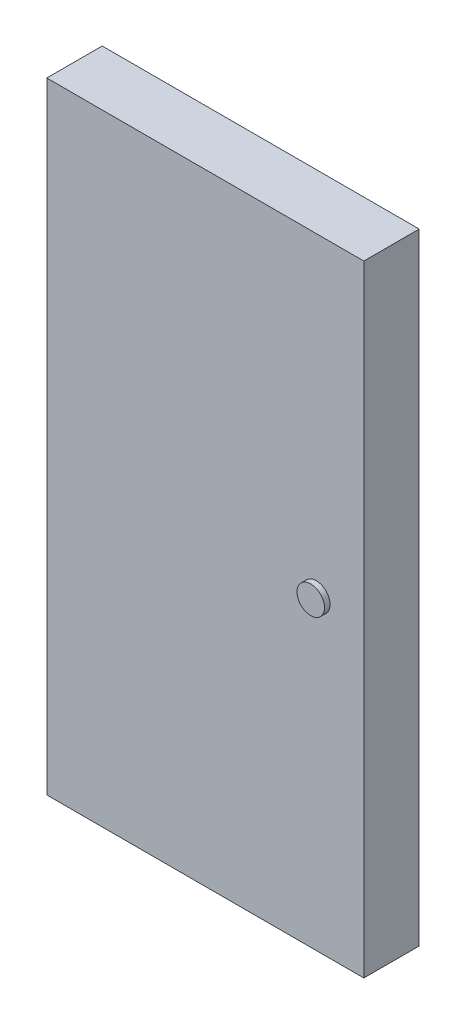
ISO-10303-21;
HEADER;
FILE_DESCRIPTION(('STEP AP214'),'2;1');
FILE_NAME('part.step','',(''),(''),'','','');
FILE_SCHEMA(('AUTOMOTIVE_DESIGN { 1 0 10303 214 1 1 1 1 }'));
ENDSEC;
DATA;
#1=APPLICATION_CONTEXT('core data for automotive mechanical design processes');
#2=APPLICATION_PROTOCOL_DEFINITION('international standard','automotive_design',2000,#1);
#3=PRODUCT_CONTEXT('',#1,'mechanical');
#4=PRODUCT('Part','Part','',(#3));
#5=PRODUCT_RELATED_PRODUCT_CATEGORY('part','',(#4));
#6=PRODUCT_DEFINITION_FORMATION('','',#4);
#7=PRODUCT_DEFINITION_CONTEXT('part definition',#1,'design');
#8=PRODUCT_DEFINITION('design','',#6,#7);
#9=PRODUCT_DEFINITION_SHAPE('','',#8);
#10=(LENGTH_UNIT() NAMED_UNIT(*) SI_UNIT(.MILLI.,.METRE.));
#11=(NAMED_UNIT(*) PLANE_ANGLE_UNIT() SI_UNIT($,.RADIAN.));
#12=(NAMED_UNIT(*) SI_UNIT($,.STERADIAN.) SOLID_ANGLE_UNIT());
#13=UNCERTAINTY_MEASURE_WITH_UNIT(LENGTH_MEASURE(1.E-05),#10,'distance_accuracy_value','');
#14=(GEOMETRIC_REPRESENTATION_CONTEXT(3) GLOBAL_UNCERTAINTY_ASSIGNED_CONTEXT((#13)) GLOBAL_UNIT_ASSIGNED_CONTEXT((#10,
#11,#12)) REPRESENTATION_CONTEXT('',''));
#15=CARTESIAN_POINT('',(0.,0.,0.));
#16=DIRECTION('',(0.,0.,1.));
#17=DIRECTION('',(1.,0.,0.));
#18=AXIS2_PLACEMENT_3D('',#15,#16,#17);
#19=CARTESIAN_POINT('',(-1459.65539059925,1702.6473374613,300.));
#20=DIRECTION('',(1.,0.,0.));
#21=DIRECTION('',(0.,1.,0.));
#22=AXIS2_PLACEMENT_3D('',#19,#20,#21);
#23=PLANE('',#22);
#24=DIRECTION('',(0.,-1.,0.));
#25=VECTOR('',#24,1.);
#26=CARTESIAN_POINT('',(-1459.65539059925,1702.6473374613,0.));
#27=LINE('',#26,#25);
#28=CARTESIAN_POINT('',(-1459.65539059925,1702.6473374613,0.));
#29=VERTEX_POINT('',#28);
#30=CARTESIAN_POINT('',(-1459.65539059925,-1660.1826625387,0.));
#31=VERTEX_POINT('',#30);
#32=EDGE_CURVE('E107',#29,#31,#27,.T.);
#33=ORIENTED_EDGE('',*,*,#32,.T.);
#34=DIRECTION('',(0.,0.,-1.));
#35=VECTOR('',#34,1.);
#36=CARTESIAN_POINT('',(-1459.65539059925,-1660.1826625387,300.));
#37=LINE('',#36,#35);
#38=CARTESIAN_POINT('',(-1459.65539059925,-1660.1826625387,300.));
#39=VERTEX_POINT('',#38);
#40=EDGE_CURVE('E11',#39,#31,#37,.T.);
#41=ORIENTED_EDGE('',*,*,#40,.F.);
#42=DIRECTION('',(0.,-1.,0.));
#43=VECTOR('',#42,1.);
#44=CARTESIAN_POINT('',(-1459.65539059925,1702.6473374613,300.));
#45=LINE('',#44,#43);
#46=CARTESIAN_POINT('',(-1459.65539059925,1702.6473374613,300.));
#47=VERTEX_POINT('',#46);
#48=EDGE_CURVE('E91',#47,#39,#45,.T.);
#49=ORIENTED_EDGE('',*,*,#48,.F.);
#50=DIRECTION('',(0.,0.,-1.));
#51=VECTOR('',#50,1.);
#52=CARTESIAN_POINT('',(-1459.65539059925,1702.6473374613,300.));
#53=LINE('',#52,#51);
#54=EDGE_CURVE('E103',#47,#29,#53,.T.);
#55=ORIENTED_EDGE('',*,*,#54,.T.);
#56=EDGE_LOOP('',(#33,#41,#49,#55));
#57=FACE_BOUND('',#56,.T.);
#58=ADVANCED_FACE('F39',(#57),#23,.F.);
#59=CARTESIAN_POINT('',(-1459.65539059925,-1660.1826625387,300.));
#60=DIRECTION('',(0.,1.,0.));
#61=DIRECTION('',(0.,0.,1.));
#62=AXIS2_PLACEMENT_3D('',#59,#60,#61);
#63=PLANE('',#62);
#64=DIRECTION('',(1.,0.,0.));
#65=VECTOR('',#64,1.);
#66=CARTESIAN_POINT('',(-1459.65539059925,-1660.1826625387,0.));
#67=LINE('',#66,#65);
#68=CARTESIAN_POINT('',(257.394609400755,-1660.1826625387,0.));
#69=VERTEX_POINT('',#68);
#70=EDGE_CURVE('E96',#31,#69,#67,.T.);
#71=ORIENTED_EDGE('',*,*,#70,.T.);
#72=DIRECTION('',(0.,0.,-1.));
#73=VECTOR('',#72,1.);
#74=CARTESIAN_POINT('',(257.394609400755,-1660.1826625387,300.));
#75=LINE('',#74,#73);
#76=CARTESIAN_POINT('',(257.394609400755,-1660.1826625387,300.));
#77=VERTEX_POINT('',#76);
#78=EDGE_CURVE('E48',#77,#69,#75,.T.);
#79=ORIENTED_EDGE('',*,*,#78,.F.);
#80=DIRECTION('',(1.,0.,0.));
#81=VECTOR('',#80,1.);
#82=CARTESIAN_POINT('',(-1459.65539059925,-1660.1826625387,300.));
#83=LINE('',#82,#81);
#84=EDGE_CURVE('E86',#39,#77,#83,.T.);
#85=ORIENTED_EDGE('',*,*,#84,.F.);
#86=ORIENTED_EDGE('',*,*,#40,.T.);
#87=EDGE_LOOP('',(#71,#79,#85,#86));
#88=FACE_BOUND('',#87,.T.);
#89=ADVANCED_FACE('F95',(#88),#63,.F.);
#90=CARTESIAN_POINT('',(257.394609400754,1702.6473374613,300.));
#91=DIRECTION('',(-1.,0.,0.));
#92=DIRECTION('',(0.,-1.,0.));
#93=AXIS2_PLACEMENT_3D('',#90,#91,#92);
#94=PLANE('',#93);
#95=DIRECTION('',(0.,1.,0.));
#96=VECTOR('',#95,1.);
#97=CARTESIAN_POINT('',(257.394609400754,1702.6473374613,0.));
#98=LINE('',#97,#96);
#99=CARTESIAN_POINT('',(257.394609400754,1702.6473374613,0.));
#100=VERTEX_POINT('',#99);
#101=EDGE_CURVE('E73',#69,#100,#98,.T.);
#102=ORIENTED_EDGE('',*,*,#101,.T.);
#103=DIRECTION('',(0.,0.,-1.));
#104=VECTOR('',#103,1.);
#105=CARTESIAN_POINT('',(257.394609400754,1702.6473374613,300.));
#106=LINE('',#105,#104);
#107=CARTESIAN_POINT('',(257.394609400754,1702.6473374613,300.));
#108=VERTEX_POINT('',#107);
#109=EDGE_CURVE('E98',#108,#100,#106,.T.);
#110=ORIENTED_EDGE('',*,*,#109,.F.);
#111=DIRECTION('',(0.,1.,0.));
#112=VECTOR('',#111,1.);
#113=CARTESIAN_POINT('',(257.394609400754,1702.6473374613,300.));
#114=LINE('',#113,#112);
#115=EDGE_CURVE('E89',#77,#108,#114,.T.);
#116=ORIENTED_EDGE('',*,*,#115,.F.);
#117=ORIENTED_EDGE('',*,*,#78,.T.);
#118=EDGE_LOOP('',(#102,#110,#116,#117));
#119=FACE_BOUND('',#118,.T.);
#120=ADVANCED_FACE('F99',(#119),#94,.F.);
#121=CARTESIAN_POINT('',(-1459.65539059925,1702.6473374613,300.));
#122=DIRECTION('',(0.,-1.,0.));
#123=DIRECTION('',(0.,0.,-1.));
#124=AXIS2_PLACEMENT_3D('',#121,#122,#123);
#125=PLANE('',#124);
#126=DIRECTION('',(-1.,0.,0.));
#127=VECTOR('',#126,1.);
#128=CARTESIAN_POINT('',(-1459.65539059925,1702.6473374613,0.));
#129=LINE('',#128,#127);
#130=EDGE_CURVE('E79',#100,#29,#129,.T.);
#131=ORIENTED_EDGE('',*,*,#130,.T.);
#132=ORIENTED_EDGE('',*,*,#54,.F.);
#133=DIRECTION('',(-1.,0.,0.));
#134=VECTOR('',#133,1.);
#135=CARTESIAN_POINT('',(-1459.65539059925,1702.6473374613,300.));
#136=LINE('',#135,#134);
#137=EDGE_CURVE('E56',#108,#47,#136,.T.);
#138=ORIENTED_EDGE('',*,*,#137,.F.);
#139=ORIENTED_EDGE('',*,*,#109,.T.);
#140=EDGE_LOOP('',(#131,#132,#138,#139));
#141=FACE_BOUND('',#140,.T.);
#142=ADVANCED_FACE('F121',(#141),#125,.F.);
#143=CARTESIAN_POINT('',(0.,0.,300.));
#144=DIRECTION('',(0.,0.,1.));
#145=DIRECTION('',(1.,0.,0.));
#146=AXIS2_PLACEMENT_3D('',#143,#144,#145);
#147=PLANE('',#146);
#148=CARTESIAN_POINT('',(0.,0.,300.));
#149=DIRECTION('',(0.,0.,1.));
#150=DIRECTION('',(1.,0.,0.));
#151=AXIS2_PLACEMENT_3D('',#148,#149,#150);
#152=CIRCLE('',#151,74.4612958191532);
#153=CARTESIAN_POINT('',(74.4612958191532,0.,300.));
#154=VERTEX_POINT('',#153);
#155=EDGE_CURVE('E128',#154,#154,#152,.T.);
#156=ORIENTED_EDGE('',*,*,#155,.F.);
#157=EDGE_LOOP('',(#156));
#158=FACE_BOUND('',#157,.T.);
#159=ORIENTED_EDGE('',*,*,#48,.T.);
#160=ORIENTED_EDGE('',*,*,#84,.T.);
#161=ORIENTED_EDGE('',*,*,#115,.T.);
#162=ORIENTED_EDGE('',*,*,#137,.T.);
#163=EDGE_LOOP('',(#159,#160,#161,#162));
#164=FACE_BOUND('',#163,.T.);
#165=ADVANCED_FACE('F87',(#158,#164),#147,.T.);
#166=CARTESIAN_POINT('',(0.,0.,0.));
#167=DIRECTION('',(0.,0.,1.));
#168=DIRECTION('',(1.,0.,0.));
#169=AXIS2_PLACEMENT_3D('',#166,#167,#168);
#170=PLANE('',#169);
#171=ORIENTED_EDGE('',*,*,#32,.F.);
#172=ORIENTED_EDGE('',*,*,#130,.F.);
#173=ORIENTED_EDGE('',*,*,#101,.F.);
#174=ORIENTED_EDGE('',*,*,#70,.F.);
#175=EDGE_LOOP('',(#171,#172,#173,#174));
#176=FACE_BOUND('',#175,.T.);
#177=ADVANCED_FACE('F124',(#176),#170,.F.);
#178=CARTESIAN_POINT('',(0.,0.,330.));
#179=DIRECTION('',(0.,0.,-1.));
#180=DIRECTION('',(-1.,0.,0.));
#181=AXIS2_PLACEMENT_3D('',#178,#179,#180);
#182=CYLINDRICAL_SURFACE('',#181,74.4612958191532);
#183=CARTESIAN_POINT('',(0.,0.,330.));
#184=DIRECTION('',(0.,0.,1.));
#185=DIRECTION('',(1.,0.,0.));
#186=AXIS2_PLACEMENT_3D('',#183,#184,#185);
#187=CIRCLE('',#186,74.4612958191532);
#188=CARTESIAN_POINT('',(74.4612958191532,0.,330.));
#189=VERTEX_POINT('',#188);
#190=EDGE_CURVE('E111',#189,#189,#187,.T.);
#191=ORIENTED_EDGE('',*,*,#190,.F.);
#192=EDGE_LOOP('',(#191));
#193=FACE_BOUND('',#192,.T.);
#194=ORIENTED_EDGE('',*,*,#155,.T.);
#195=EDGE_LOOP('',(#194));
#196=FACE_BOUND('',#195,.T.);
#197=ADVANCED_FACE('F138',(#193,#196),#182,.T.);
#198=CARTESIAN_POINT('',(0.,0.,330.));
#199=DIRECTION('',(0.,0.,1.));
#200=DIRECTION('',(1.,0.,0.));
#201=AXIS2_PLACEMENT_3D('',#198,#199,#200);
#202=PLANE('',#201);
#203=ORIENTED_EDGE('',*,*,#190,.T.);
#204=EDGE_LOOP('',(#203));
#205=FACE_BOUND('',#204,.T.);
#206=ADVANCED_FACE('F136',(#205),#202,.T.);
#207=CLOSED_SHELL('',(#58,#89,#120,#142,#165,#177,#197,#206));
#208=MANIFOLD_SOLID_BREP('B2',#207);
#209=ADVANCED_BREP_SHAPE_REPRESENTATION('',(#18,#208),#14);
#210=SHAPE_DEFINITION_REPRESENTATION(#9,#209);
ENDSEC;
END-ISO-10303-21;
